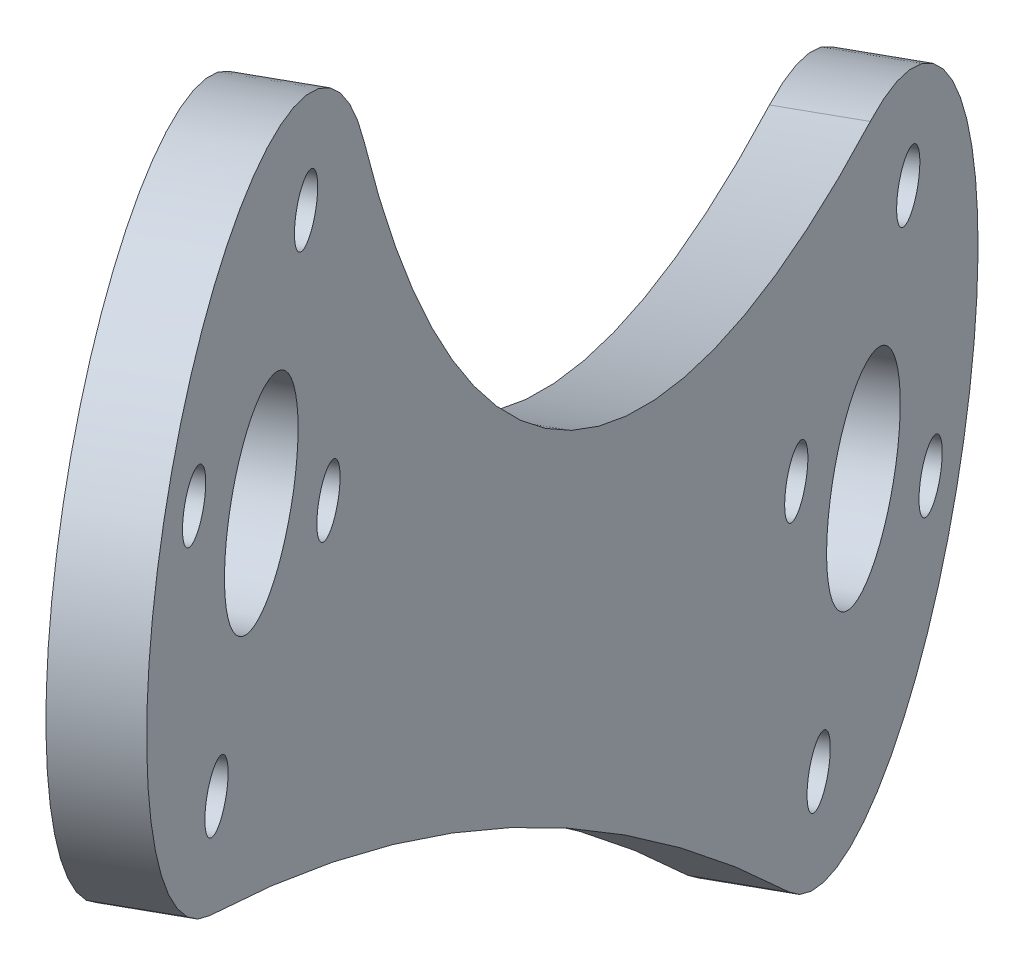
ISO-10303-21;
HEADER;
FILE_DESCRIPTION(('STEP AP214'),'2;1');
FILE_NAME('part.step','',(''),(''),'','','');
FILE_SCHEMA(('AUTOMOTIVE_DESIGN { 1 0 10303 214 1 1 1 1 }'));
ENDSEC;
DATA;
#1=APPLICATION_CONTEXT('core data for automotive mechanical design processes');
#2=APPLICATION_PROTOCOL_DEFINITION('international standard','automotive_design',2000,#1);
#3=PRODUCT_CONTEXT('',#1,'mechanical');
#4=PRODUCT('Part','Part','',(#3));
#5=PRODUCT_RELATED_PRODUCT_CATEGORY('part','',(#4));
#6=PRODUCT_DEFINITION_FORMATION('','',#4);
#7=PRODUCT_DEFINITION_CONTEXT('part definition',#1,'design');
#8=PRODUCT_DEFINITION('design','',#6,#7);
#9=PRODUCT_DEFINITION_SHAPE('','',#8);
#10=(LENGTH_UNIT() NAMED_UNIT(*) SI_UNIT(.MILLI.,.METRE.));
#11=(NAMED_UNIT(*) PLANE_ANGLE_UNIT() SI_UNIT($,.RADIAN.));
#12=(NAMED_UNIT(*) SI_UNIT($,.STERADIAN.) SOLID_ANGLE_UNIT());
#13=UNCERTAINTY_MEASURE_WITH_UNIT(LENGTH_MEASURE(1.E-05),#10,'distance_accuracy_value','');
#14=(GEOMETRIC_REPRESENTATION_CONTEXT(3) GLOBAL_UNCERTAINTY_ASSIGNED_CONTEXT((#13)) GLOBAL_UNIT_ASSIGNED_CONTEXT((#10,
#11,#12)) REPRESENTATION_CONTEXT('',''));
#15=CARTESIAN_POINT('',(0.,0.,0.));
#16=DIRECTION('',(0.,0.,1.));
#17=DIRECTION('',(1.,0.,0.));
#18=AXIS2_PLACEMENT_3D('',#15,#16,#17);
#19=CARTESIAN_POINT('',(111.911596656308,67.6537550601654,142.208933520763));
#20=DIRECTION('',(-0.872839337391939,0.,0.48800767524825));
#21=DIRECTION('',(0.48800767524825,0.,0.872839337391939));
#22=AXIS2_PLACEMENT_3D('',#19,#20,#21);
#23=CYLINDRICAL_SURFACE('',#22,12.065);
#24=CARTESIAN_POINT('',(109.293078644133,67.6537550601655,143.672956546508));
#25=DIRECTION('',(-0.872839337391939,0.,0.48800767524825));
#26=DIRECTION('',(0.48800767524825,0.,0.872839337391939));
#27=AXIS2_PLACEMENT_3D('',#24,#25,#26);
#28=CIRCLE('',#27,12.065);
#29=CARTESIAN_POINT('',(111.946697587866,56.8836065862864,148.419158538845));
#30=VERTEX_POINT('',#29);
#31=CARTESIAN_POINT('',(104.002375438691,72.9478578940215,134.210126114946));
#32=VERTEX_POINT('',#31);
#33=EDGE_CURVE('E99',#30,#32,#28,.T.);
#34=ORIENTED_EDGE('',*,*,#33,.F.);
#35=DIRECTION('',(-0.872839337391939,0.,0.48800767524825));
#36=VECTOR('',#35,1.);
#37=CARTESIAN_POINT('',(114.565215600042,56.8836065862864,146.9551355131));
#38=LINE('',#37,#36);
#39=CARTESIAN_POINT('',(114.565215600042,56.8836065862864,146.9551355131));
#40=VERTEX_POINT('',#39);
#41=EDGE_CURVE('E11',#40,#30,#38,.T.);
#42=ORIENTED_EDGE('',*,*,#41,.F.);
#43=CARTESIAN_POINT('',(111.911596656308,67.6537550601654,142.208933520763));
#44=DIRECTION('',(-0.872839337391939,0.,0.48800767524825));
#45=DIRECTION('',(0.48800767524825,0.,0.872839337391939));
#46=AXIS2_PLACEMENT_3D('',#43,#44,#45);
#47=CIRCLE('',#46,12.065);
#48=CARTESIAN_POINT('',(106.620893450867,72.9478578940215,132.746103089202));
#49=VERTEX_POINT('',#48);
#50=EDGE_CURVE('E92',#40,#49,#47,.T.);
#51=ORIENTED_EDGE('',*,*,#50,.T.);
#52=DIRECTION('',(-0.872839337391939,0.,0.48800767524825));
#53=VECTOR('',#52,1.);
#54=CARTESIAN_POINT('',(106.620893450867,72.9478578940215,132.746103089202));
#55=LINE('',#54,#53);
#56=EDGE_CURVE('E37',#49,#32,#55,.T.);
#57=ORIENTED_EDGE('',*,*,#56,.T.);
#58=EDGE_LOOP('',(#34,#42,#51,#57));
#59=FACE_BOUND('',#58,.T.);
#60=ADVANCED_FACE('F34',(#59),#23,.T.);
#61=CARTESIAN_POINT('',(181.604009968041,-215.204354859077,266.859185845821));
#62=DIRECTION('',(-0.872839337391939,0.,0.48800767524825));
#63=DIRECTION('',(0.48800767524825,0.,0.872839337391939));
#64=AXIS2_PLACEMENT_3D('',#61,#62,#63);
#65=CYLINDRICAL_SURFACE('',#64,304.8);
#66=CARTESIAN_POINT('',(178.985491955865,-215.204354859077,268.323208871565));
#67=DIRECTION('',(0.872839337391939,0.,-0.48800767524825));
#68=DIRECTION('',(-0.48800767524825,0.,-0.872839337391939));
#69=AXIS2_PLACEMENT_3D('',#66,#67,#68);
#70=CIRCLE('',#69,304.8);
#71=CARTESIAN_POINT('',(82.185523297096,16.2202622398334,95.1890046590989));
#72=VERTEX_POINT('',#71);
#73=EDGE_CURVE('E94',#72,#30,#70,.T.);
#74=ORIENTED_EDGE('',*,*,#73,.F.);
#75=DIRECTION('',(-0.872839337391939,0.,0.48800767524825));
#76=VECTOR('',#75,1.);
#77=CARTESIAN_POINT('',(84.8040413092718,16.2202622398333,93.7249816333541));
#78=LINE('',#77,#76);
#79=CARTESIAN_POINT('',(84.8040413092718,16.2202622398333,93.7249816333541));
#80=VERTEX_POINT('',#79);
#81=EDGE_CURVE('E43',#80,#72,#78,.T.);
#82=ORIENTED_EDGE('',*,*,#81,.F.);
#83=CARTESIAN_POINT('',(181.604009968041,-215.204354859077,266.859185845821));
#84=DIRECTION('',(0.872839337391939,0.,-0.48800767524825));
#85=DIRECTION('',(-0.48800767524825,0.,-0.872839337391939));
#86=AXIS2_PLACEMENT_3D('',#83,#84,#85);
#87=CIRCLE('',#86,304.8);
#88=EDGE_CURVE('E89',#80,#40,#87,.T.);
#89=ORIENTED_EDGE('',*,*,#88,.T.);
#90=ORIENTED_EDGE('',*,*,#41,.T.);
#91=EDGE_LOOP('',(#74,#82,#89,#90));
#92=FACE_BOUND('',#91,.T.);
#93=ADVANCED_FACE('F110',(#92),#65,.F.);
#94=CARTESIAN_POINT('',(80.9723758831955,25.3808199999985,86.8717527166106));
#95=DIRECTION('',(-0.872839337391939,0.,0.48800767524825));
#96=DIRECTION('',(0.48800767524825,0.,0.872839337391939));
#97=AXIS2_PLACEMENT_3D('',#94,#95,#96);
#98=CYLINDRICAL_SURFACE('',#97,12.065);
#99=CARTESIAN_POINT('',(78.3538578710197,25.3808199999986,88.3357757423554));
#100=DIRECTION('',(-0.872839337391939,0.,0.48800767524825));
#101=DIRECTION('',(0.48800767524825,0.,0.872839337391939));
#102=AXIS2_PLACEMENT_3D('',#99,#100,#101);
#103=CIRCLE('',#102,12.065);
#104=CARTESIAN_POINT('',(78.0030302512014,37.4243830535451,87.7082935064147));
#105=VERTEX_POINT('',#104);
#106=EDGE_CURVE('E84',#105,#72,#103,.T.);
#107=ORIENTED_EDGE('',*,*,#106,.F.);
#108=DIRECTION('',(-0.872839337391939,0.,0.48800767524825));
#109=VECTOR('',#108,1.);
#110=CARTESIAN_POINT('',(80.6215482633773,37.4243830535451,86.2442704806699));
#111=LINE('',#110,#109);
#112=CARTESIAN_POINT('',(80.6215482633773,37.4243830535451,86.2442704806699));
#113=VERTEX_POINT('',#112);
#114=EDGE_CURVE('E79',#113,#105,#111,.T.);
#115=ORIENTED_EDGE('',*,*,#114,.F.);
#116=CARTESIAN_POINT('',(80.9723758831955,25.3808199999985,86.8717527166106));
#117=DIRECTION('',(-0.872839337391939,0.,0.48800767524825));
#118=DIRECTION('',(0.48800767524825,0.,0.872839337391939));
#119=AXIS2_PLACEMENT_3D('',#116,#117,#118);
#120=CIRCLE('',#119,12.065);
#121=EDGE_CURVE('E82',#113,#80,#120,.T.);
#122=ORIENTED_EDGE('',*,*,#121,.T.);
#123=ORIENTED_EDGE('',*,*,#81,.T.);
#124=EDGE_LOOP('',(#107,#115,#122,#123));
#125=FACE_BOUND('',#124,.T.);
#126=ADVANCED_FACE('F81',(#125),#98,.T.);
#127=CARTESIAN_POINT('',(78.7750871064392,100.81155701958,82.9417323967716));
#128=DIRECTION('',(-0.872839337391939,0.,0.48800767524825));
#129=DIRECTION('',(0.48800767524825,0.,0.872839337391939));
#130=AXIS2_PLACEMENT_3D('',#127,#128,#129);
#131=CYLINDRICAL_SURFACE('',#130,63.5);
#132=CARTESIAN_POINT('',(76.1565690942634,100.81155701958,84.4057554225163));
#133=DIRECTION('',(0.872839337391939,0.,-0.48800767524825));
#134=DIRECTION('',(-0.48800767524825,0.,-0.872839337391939));
#135=AXIS2_PLACEMENT_3D('',#132,#133,#134);
#136=CIRCLE('',#135,63.5);
#137=EDGE_CURVE('E102',#32,#105,#136,.T.);
#138=ORIENTED_EDGE('',*,*,#137,.F.);
#139=ORIENTED_EDGE('',*,*,#56,.F.);
#140=CARTESIAN_POINT('',(78.7750871064392,100.81155701958,82.9417323967716));
#141=DIRECTION('',(0.872839337391939,0.,-0.48800767524825));
#142=DIRECTION('',(-0.48800767524825,0.,-0.872839337391939));
#143=AXIS2_PLACEMENT_3D('',#140,#141,#142);
#144=CIRCLE('',#143,63.5);
#145=EDGE_CURVE('E88',#49,#113,#144,.T.);
#146=ORIENTED_EDGE('',*,*,#145,.T.);
#147=ORIENTED_EDGE('',*,*,#114,.T.);
#148=EDGE_LOOP('',(#138,#139,#146,#147));
#149=FACE_BOUND('',#148,.T.);
#150=ADVANCED_FACE('F91',(#149),#131,.F.);
#151=CARTESIAN_POINT('',(95.3433418813738,84.2326560398725,112.575332958767));
#152=DIRECTION('',(-0.872839337391939,0.,0.48800767524825));
#153=DIRECTION('',(0.48800767524825,0.,0.872839337391939));
#154=AXIS2_PLACEMENT_3D('',#151,#152,#153);
#155=PLANE('',#154);
#156=CARTESIAN_POINT('',(80.9723758831955,25.3808199999985,86.8717527166106));
#157=DIRECTION('',(-0.872839337391939,0.,0.48800767524825));
#158=DIRECTION('',(-0.48800767524825,0.,-0.872839337391939));
#159=AXIS2_PLACEMENT_3D('',#156,#157,#158);
#160=CIRCLE('',#159,3.8735);
#161=CARTESIAN_POINT('',(79.0820781531214,25.3808199999985,83.490809543223));
#162=VERTEX_POINT('',#161);
#163=EDGE_CURVE('E175',#162,#162,#160,.T.);
#164=ORIENTED_EDGE('',*,*,#163,.T.);
#165=EDGE_LOOP('',(#164));
#166=FACE_BOUND('',#165,.T.);
#167=CARTESIAN_POINT('',(111.911596656308,67.6537550601654,142.208933520763));
#168=DIRECTION('',(-0.872839337391939,0.,0.48800767524825));
#169=DIRECTION('',(-0.48800767524825,0.,-0.872839337391939));
#170=AXIS2_PLACEMENT_3D('',#167,#168,#169);
#171=CIRCLE('',#170,3.87349999999996);
#172=CARTESIAN_POINT('',(110.021298926234,67.6537550601654,138.827990347376));
#173=VERTEX_POINT('',#172);
#174=EDGE_CURVE('E183',#173,#173,#171,.T.);
#175=ORIENTED_EDGE('',*,*,#174,.T.);
#176=EDGE_LOOP('',(#175));
#177=FACE_BOUND('',#176,.T.);
#178=CARTESIAN_POINT('',(109.610374061214,74.72591857785,138.093019556762));
#179=DIRECTION('',(-0.872839337391939,0.,0.48800767524825));
#180=DIRECTION('',(-0.48800767524825,0.,-0.872839337391939));
#181=AXIS2_PLACEMENT_3D('',#178,#179,#180);
#182=CIRCLE('',#181,1.21919999999999);
#183=CARTESIAN_POINT('',(109.015395103551,74.72591857785,137.028853836614));
#184=VERTEX_POINT('',#183);
#185=EDGE_CURVE('E189',#184,#184,#182,.T.);
#186=ORIENTED_EDGE('',*,*,#185,.T.);
#187=EDGE_LOOP('',(#186));
#188=FACE_BOUND('',#187,.T.);
#189=CARTESIAN_POINT('',(115.362866733549,72.3693009661271,148.381796039467));
#190=DIRECTION('',(-0.872839337391939,0.,0.48800767524825));
#191=DIRECTION('',(-0.48800767524825,0.,-0.872839337391939));
#192=AXIS2_PLACEMENT_3D('',#189,#190,#191);
#193=CIRCLE('',#192,1.21919999999999);
#194=CARTESIAN_POINT('',(114.767887775887,72.3693009661271,147.317630319318));
#195=VERTEX_POINT('',#194);
#196=EDGE_CURVE('E195',#195,#195,#193,.T.);
#197=ORIENTED_EDGE('',*,*,#196,.T.);
#198=EDGE_LOOP('',(#197));
#199=FACE_BOUND('',#198,.T.);
#200=CARTESIAN_POINT('',(114.212819251403,60.5815915424809,146.324847484764));
#201=DIRECTION('',(-0.872839337391939,0.,0.48800767524825));
#202=DIRECTION('',(-0.48800767524825,0.,-0.872839337391939));
#203=AXIS2_PLACEMENT_3D('',#200,#201,#202);
#204=CIRCLE('',#203,1.21919999999997);
#205=CARTESIAN_POINT('',(113.617840293741,60.5815915424809,145.260681764616));
#206=VERTEX_POINT('',#205);
#207=EDGE_CURVE('E201',#206,#206,#204,.T.);
#208=ORIENTED_EDGE('',*,*,#207,.T.);
#209=EDGE_LOOP('',(#208));
#210=FACE_BOUND('',#209,.T.);
#211=CARTESIAN_POINT('',(108.460326579068,62.9382091542038,136.03607100206));
#212=DIRECTION('',(-0.872839337391939,0.,0.48800767524825));
#213=DIRECTION('',(-0.48800767524825,0.,-0.872839337391939));
#214=AXIS2_PLACEMENT_3D('',#211,#212,#213);
#215=CIRCLE('',#214,1.21919999999998);
#216=CARTESIAN_POINT('',(107.865347621405,62.9382091542038,134.971905281912));
#217=VERTEX_POINT('',#216);
#218=EDGE_CURVE('E207',#217,#217,#215,.T.);
#219=ORIENTED_EDGE('',*,*,#218,.T.);
#220=EDGE_LOOP('',(#219));
#221=FACE_BOUND('',#220,.T.);
#222=CARTESIAN_POINT('',(84.4236459604362,30.0963659059603,93.0446152353138));
#223=DIRECTION('',(-0.872839337391939,0.,0.48800767524825));
#224=DIRECTION('',(-0.48800767524825,0.,-0.872839337391939));
#225=AXIS2_PLACEMENT_3D('',#222,#223,#224);
#226=CIRCLE('',#225,1.21920000000001);
#227=CARTESIAN_POINT('',(83.8286670027735,30.0963659059603,91.9804495151655));
#228=VERTEX_POINT('',#227);
#229=EDGE_CURVE('E213',#228,#228,#226,.T.);
#230=ORIENTED_EDGE('',*,*,#229,.T.);
#231=EDGE_LOOP('',(#230));
#232=FACE_BOUND('',#231,.T.);
#233=CARTESIAN_POINT('',(83.2735984782902,18.3086564823142,90.9876666806113));
#234=DIRECTION('',(-0.872839337391939,0.,0.48800767524825));
#235=DIRECTION('',(-0.48800767524825,0.,-0.872839337391939));
#236=AXIS2_PLACEMENT_3D('',#233,#234,#235);
#237=CIRCLE('',#236,1.21919999999998);
#238=CARTESIAN_POINT('',(82.6786195206275,18.3086564823142,89.9235009604631));
#239=VERTEX_POINT('',#238);
#240=EDGE_CURVE('E219',#239,#239,#237,.T.);
#241=ORIENTED_EDGE('',*,*,#240,.T.);
#242=EDGE_LOOP('',(#241));
#243=FACE_BOUND('',#242,.T.);
#244=CARTESIAN_POINT('',(77.5211058059547,20.6652740940372,80.6988901979073));
#245=DIRECTION('',(-0.872839337391939,0.,0.48800767524825));
#246=DIRECTION('',(-0.48800767524825,0.,-0.872839337391939));
#247=AXIS2_PLACEMENT_3D('',#244,#245,#246);
#248=CIRCLE('',#247,1.21920000000001);
#249=CARTESIAN_POINT('',(76.926126848292,20.6652740940372,79.634724477759));
#250=VERTEX_POINT('',#249);
#251=EDGE_CURVE('E225',#250,#250,#248,.T.);
#252=ORIENTED_EDGE('',*,*,#251,.T.);
#253=EDGE_LOOP('',(#252));
#254=FACE_BOUND('',#253,.T.);
#255=CARTESIAN_POINT('',(78.6711532881007,32.4529835176833,82.7558387526097));
#256=DIRECTION('',(-0.872839337391939,0.,0.48800767524825));
#257=DIRECTION('',(-0.48800767524825,0.,-0.872839337391939));
#258=AXIS2_PLACEMENT_3D('',#255,#256,#257);
#259=CIRCLE('',#258,1.21920000000001);
#260=CARTESIAN_POINT('',(78.0761743304381,32.4529835176833,81.6916730324615));
#261=VERTEX_POINT('',#260);
#262=EDGE_CURVE('E103',#261,#261,#259,.T.);
#263=ORIENTED_EDGE('',*,*,#262,.T.);
#264=EDGE_LOOP('',(#263));
#265=FACE_BOUND('',#264,.T.);
#266=ORIENTED_EDGE('',*,*,#50,.F.);
#267=ORIENTED_EDGE('',*,*,#88,.F.);
#268=ORIENTED_EDGE('',*,*,#121,.F.);
#269=ORIENTED_EDGE('',*,*,#145,.F.);
#270=EDGE_LOOP('',(#266,#267,#268,#269));
#271=FACE_BOUND('',#270,.T.);
#272=ADVANCED_FACE('F87',(#166,#177,#188,#199,#210,#221,#232,#243,#254,#265,#271),#155,.F.);
#273=CARTESIAN_POINT('',(92.724823869198,84.2326560398725,114.039355984512));
#274=DIRECTION('',(-0.872839337391939,0.,0.48800767524825));
#275=DIRECTION('',(0.48800767524825,0.,0.872839337391939));
#276=AXIS2_PLACEMENT_3D('',#273,#274,#275);
#277=PLANE('',#276);
#278=CARTESIAN_POINT('',(78.3538578710197,25.3808199999986,88.3357757423554));
#279=DIRECTION('',(-0.872839337391939,0.,0.48800767524825));
#280=DIRECTION('',(-0.48800767524825,0.,-0.872839337391939));
#281=AXIS2_PLACEMENT_3D('',#278,#279,#280);
#282=CIRCLE('',#281,3.8735);
#283=CARTESIAN_POINT('',(76.4635601409456,25.3808199999986,84.9548325689677));
#284=VERTEX_POINT('',#283);
#285=EDGE_CURVE('E178',#284,#284,#282,.T.);
#286=ORIENTED_EDGE('',*,*,#285,.F.);
#287=EDGE_LOOP('',(#286));
#288=FACE_BOUND('',#287,.T.);
#289=CARTESIAN_POINT('',(109.293078644133,67.6537550601655,143.672956546508));
#290=DIRECTION('',(-0.872839337391939,0.,0.48800767524825));
#291=DIRECTION('',(-0.48800767524825,0.,-0.872839337391939));
#292=AXIS2_PLACEMENT_3D('',#289,#290,#291);
#293=CIRCLE('',#292,3.87349999999996);
#294=CARTESIAN_POINT('',(107.402780914059,67.6537550601655,140.29201337312));
#295=VERTEX_POINT('',#294);
#296=EDGE_CURVE('E180',#295,#295,#293,.T.);
#297=ORIENTED_EDGE('',*,*,#296,.F.);
#298=EDGE_LOOP('',(#297));
#299=FACE_BOUND('',#298,.T.);
#300=CARTESIAN_POINT('',(106.991856049038,74.72591857785,139.557042582507));
#301=DIRECTION('',(-0.872839337391939,0.,0.48800767524825));
#302=DIRECTION('',(-0.48800767524825,0.,-0.872839337391939));
#303=AXIS2_PLACEMENT_3D('',#300,#301,#302);
#304=CIRCLE('',#303,1.21919999999999);
#305=CARTESIAN_POINT('',(106.396877091375,74.72591857785,138.492876862359));
#306=VERTEX_POINT('',#305);
#307=EDGE_CURVE('E186',#306,#306,#304,.T.);
#308=ORIENTED_EDGE('',*,*,#307,.F.);
#309=EDGE_LOOP('',(#308));
#310=FACE_BOUND('',#309,.T.);
#311=CARTESIAN_POINT('',(112.744348721373,72.3693009661271,149.845819065211));
#312=DIRECTION('',(-0.872839337391939,0.,0.48800767524825));
#313=DIRECTION('',(-0.48800767524825,0.,-0.872839337391939));
#314=AXIS2_PLACEMENT_3D('',#311,#312,#313);
#315=CIRCLE('',#314,1.21919999999999);
#316=CARTESIAN_POINT('',(112.149369763711,72.3693009661271,148.781653345063));
#317=VERTEX_POINT('',#316);
#318=EDGE_CURVE('E192',#317,#317,#315,.T.);
#319=ORIENTED_EDGE('',*,*,#318,.F.);
#320=EDGE_LOOP('',(#319));
#321=FACE_BOUND('',#320,.T.);
#322=CARTESIAN_POINT('',(111.594301239227,60.5815915424809,147.788870510509));
#323=DIRECTION('',(-0.872839337391939,0.,0.48800767524825));
#324=DIRECTION('',(-0.48800767524825,0.,-0.872839337391939));
#325=AXIS2_PLACEMENT_3D('',#322,#323,#324);
#326=CIRCLE('',#325,1.21919999999997);
#327=CARTESIAN_POINT('',(110.999322281565,60.5815915424809,146.724704790361));
#328=VERTEX_POINT('',#327);
#329=EDGE_CURVE('E198',#328,#328,#326,.T.);
#330=ORIENTED_EDGE('',*,*,#329,.F.);
#331=EDGE_LOOP('',(#330));
#332=FACE_BOUND('',#331,.T.);
#333=CARTESIAN_POINT('',(105.841808566892,62.9382091542038,137.500094027805));
#334=DIRECTION('',(-0.872839337391939,0.,0.48800767524825));
#335=DIRECTION('',(-0.48800767524825,0.,-0.872839337391939));
#336=AXIS2_PLACEMENT_3D('',#333,#334,#335);
#337=CIRCLE('',#336,1.21919999999998);
#338=CARTESIAN_POINT('',(105.246829609229,62.9382091542038,136.435928307657));
#339=VERTEX_POINT('',#338);
#340=EDGE_CURVE('E204',#339,#339,#337,.T.);
#341=ORIENTED_EDGE('',*,*,#340,.F.);
#342=EDGE_LOOP('',(#341));
#343=FACE_BOUND('',#342,.T.);
#344=CARTESIAN_POINT('',(81.8051279482604,30.0963659059603,94.5086382610585));
#345=DIRECTION('',(-0.872839337391939,0.,0.48800767524825));
#346=DIRECTION('',(-0.48800767524825,0.,-0.872839337391939));
#347=AXIS2_PLACEMENT_3D('',#344,#345,#346);
#348=CIRCLE('',#347,1.21920000000001);
#349=CARTESIAN_POINT('',(81.2101489905977,30.0963659059603,93.4444725409103));
#350=VERTEX_POINT('',#349);
#351=EDGE_CURVE('E210',#350,#350,#348,.T.);
#352=ORIENTED_EDGE('',*,*,#351,.F.);
#353=EDGE_LOOP('',(#352));
#354=FACE_BOUND('',#353,.T.);
#355=CARTESIAN_POINT('',(80.6550804661143,18.3086564823142,92.4516897063561));
#356=DIRECTION('',(-0.872839337391939,0.,0.48800767524825));
#357=DIRECTION('',(-0.48800767524825,0.,-0.872839337391939));
#358=AXIS2_PLACEMENT_3D('',#355,#356,#357);
#359=CIRCLE('',#358,1.21919999999998);
#360=CARTESIAN_POINT('',(80.0601015084517,18.3086564823142,91.3875239862079));
#361=VERTEX_POINT('',#360);
#362=EDGE_CURVE('E216',#361,#361,#359,.T.);
#363=ORIENTED_EDGE('',*,*,#362,.F.);
#364=EDGE_LOOP('',(#363));
#365=FACE_BOUND('',#364,.T.);
#366=CARTESIAN_POINT('',(74.9025877937788,20.6652740940372,82.162913223652));
#367=DIRECTION('',(-0.872839337391939,0.,0.48800767524825));
#368=DIRECTION('',(-0.48800767524825,0.,-0.872839337391939));
#369=AXIS2_PLACEMENT_3D('',#366,#367,#368);
#370=CIRCLE('',#369,1.21920000000001);
#371=CARTESIAN_POINT('',(74.3076088361162,20.6652740940372,81.0987475035037));
#372=VERTEX_POINT('',#371);
#373=EDGE_CURVE('E222',#372,#372,#370,.T.);
#374=ORIENTED_EDGE('',*,*,#373,.F.);
#375=EDGE_LOOP('',(#374));
#376=FACE_BOUND('',#375,.T.);
#377=CARTESIAN_POINT('',(76.0526352759249,32.4529835176833,84.2198617783545));
#378=DIRECTION('',(-0.872839337391939,0.,0.48800767524825));
#379=DIRECTION('',(-0.48800767524825,0.,-0.872839337391939));
#380=AXIS2_PLACEMENT_3D('',#377,#378,#379);
#381=CIRCLE('',#380,1.21920000000001);
#382=CARTESIAN_POINT('',(75.4576563182622,32.4529835176833,83.1556960582062));
#383=VERTEX_POINT('',#382);
#384=EDGE_CURVE('E228',#383,#383,#381,.T.);
#385=ORIENTED_EDGE('',*,*,#384,.F.);
#386=EDGE_LOOP('',(#385));
#387=FACE_BOUND('',#386,.T.);
#388=ORIENTED_EDGE('',*,*,#33,.T.);
#389=ORIENTED_EDGE('',*,*,#137,.T.);
#390=ORIENTED_EDGE('',*,*,#106,.T.);
#391=ORIENTED_EDGE('',*,*,#73,.T.);
#392=EDGE_LOOP('',(#388,#389,#390,#391));
#393=FACE_BOUND('',#392,.T.);
#394=ADVANCED_FACE('F109',(#288,#299,#310,#321,#332,#343,#354,#365,#376,#387,#393),#277,.T.);
#395=CARTESIAN_POINT('',(78.6711532881007,32.4529835176833,82.7558387526097));
#396=DIRECTION('',(-0.872839337391939,0.,0.48800767524825));
#397=DIRECTION('',(0.48800767524825,0.,0.872839337391939));
#398=AXIS2_PLACEMENT_3D('',#395,#396,#397);
#399=CYLINDRICAL_SURFACE('',#398,1.21920000000001);
#400=ORIENTED_EDGE('',*,*,#262,.F.);
#401=EDGE_LOOP('',(#400));
#402=FACE_BOUND('',#401,.T.);
#403=ORIENTED_EDGE('',*,*,#384,.T.);
#404=EDGE_LOOP('',(#403));
#405=FACE_BOUND('',#404,.T.);
#406=ADVANCED_FACE('F128',(#402,#405),#399,.F.);
#407=CARTESIAN_POINT('',(77.5211058059547,20.6652740940372,80.6988901979073));
#408=DIRECTION('',(-0.872839337391939,0.,0.48800767524825));
#409=DIRECTION('',(0.48800767524825,0.,0.872839337391939));
#410=AXIS2_PLACEMENT_3D('',#407,#408,#409);
#411=CYLINDRICAL_SURFACE('',#410,1.21920000000001);
#412=ORIENTED_EDGE('',*,*,#251,.F.);
#413=EDGE_LOOP('',(#412));
#414=FACE_BOUND('',#413,.T.);
#415=ORIENTED_EDGE('',*,*,#373,.T.);
#416=EDGE_LOOP('',(#415));
#417=FACE_BOUND('',#416,.T.);
#418=ADVANCED_FACE('F135',(#414,#417),#411,.F.);
#419=CARTESIAN_POINT('',(83.2735984782902,18.3086564823142,90.9876666806113));
#420=DIRECTION('',(-0.872839337391939,0.,0.48800767524825));
#421=DIRECTION('',(0.48800767524825,0.,0.872839337391939));
#422=AXIS2_PLACEMENT_3D('',#419,#420,#421);
#423=CYLINDRICAL_SURFACE('',#422,1.21919999999998);
#424=ORIENTED_EDGE('',*,*,#240,.F.);
#425=EDGE_LOOP('',(#424));
#426=FACE_BOUND('',#425,.T.);
#427=ORIENTED_EDGE('',*,*,#362,.T.);
#428=EDGE_LOOP('',(#427));
#429=FACE_BOUND('',#428,.T.);
#430=ADVANCED_FACE('F139',(#426,#429),#423,.F.);
#431=CARTESIAN_POINT('',(84.4236459604362,30.0963659059603,93.0446152353138));
#432=DIRECTION('',(-0.872839337391939,0.,0.48800767524825));
#433=DIRECTION('',(0.48800767524825,0.,0.872839337391939));
#434=AXIS2_PLACEMENT_3D('',#431,#432,#433);
#435=CYLINDRICAL_SURFACE('',#434,1.21920000000001);
#436=ORIENTED_EDGE('',*,*,#229,.F.);
#437=EDGE_LOOP('',(#436));
#438=FACE_BOUND('',#437,.T.);
#439=ORIENTED_EDGE('',*,*,#351,.T.);
#440=EDGE_LOOP('',(#439));
#441=FACE_BOUND('',#440,.T.);
#442=ADVANCED_FACE('F143',(#438,#441),#435,.F.);
#443=CARTESIAN_POINT('',(108.460326579068,62.9382091542038,136.03607100206));
#444=DIRECTION('',(-0.872839337391939,0.,0.48800767524825));
#445=DIRECTION('',(0.48800767524825,0.,0.872839337391939));
#446=AXIS2_PLACEMENT_3D('',#443,#444,#445);
#447=CYLINDRICAL_SURFACE('',#446,1.21919999999998);
#448=ORIENTED_EDGE('',*,*,#218,.F.);
#449=EDGE_LOOP('',(#448));
#450=FACE_BOUND('',#449,.T.);
#451=ORIENTED_EDGE('',*,*,#340,.T.);
#452=EDGE_LOOP('',(#451));
#453=FACE_BOUND('',#452,.T.);
#454=ADVANCED_FACE('F147',(#450,#453),#447,.F.);
#455=CARTESIAN_POINT('',(114.212819251403,60.5815915424809,146.324847484764));
#456=DIRECTION('',(-0.872839337391939,0.,0.48800767524825));
#457=DIRECTION('',(0.48800767524825,0.,0.872839337391939));
#458=AXIS2_PLACEMENT_3D('',#455,#456,#457);
#459=CYLINDRICAL_SURFACE('',#458,1.21919999999997);
#460=ORIENTED_EDGE('',*,*,#207,.F.);
#461=EDGE_LOOP('',(#460));
#462=FACE_BOUND('',#461,.T.);
#463=ORIENTED_EDGE('',*,*,#329,.T.);
#464=EDGE_LOOP('',(#463));
#465=FACE_BOUND('',#464,.T.);
#466=ADVANCED_FACE('F151',(#462,#465),#459,.F.);
#467=CARTESIAN_POINT('',(115.362866733549,72.3693009661271,148.381796039467));
#468=DIRECTION('',(-0.872839337391939,0.,0.48800767524825));
#469=DIRECTION('',(0.48800767524825,0.,0.872839337391939));
#470=AXIS2_PLACEMENT_3D('',#467,#468,#469);
#471=CYLINDRICAL_SURFACE('',#470,1.21919999999999);
#472=ORIENTED_EDGE('',*,*,#196,.F.);
#473=EDGE_LOOP('',(#472));
#474=FACE_BOUND('',#473,.T.);
#475=ORIENTED_EDGE('',*,*,#318,.T.);
#476=EDGE_LOOP('',(#475));
#477=FACE_BOUND('',#476,.T.);
#478=ADVANCED_FACE('F155',(#474,#477),#471,.F.);
#479=CARTESIAN_POINT('',(109.610374061214,74.72591857785,138.093019556762));
#480=DIRECTION('',(-0.872839337391939,0.,0.48800767524825));
#481=DIRECTION('',(0.48800767524825,0.,0.872839337391939));
#482=AXIS2_PLACEMENT_3D('',#479,#480,#481);
#483=CYLINDRICAL_SURFACE('',#482,1.21919999999999);
#484=ORIENTED_EDGE('',*,*,#185,.F.);
#485=EDGE_LOOP('',(#484));
#486=FACE_BOUND('',#485,.T.);
#487=ORIENTED_EDGE('',*,*,#307,.T.);
#488=EDGE_LOOP('',(#487));
#489=FACE_BOUND('',#488,.T.);
#490=ADVANCED_FACE('F159',(#486,#489),#483,.F.);
#491=CARTESIAN_POINT('',(111.911596656308,67.6537550601654,142.208933520763));
#492=DIRECTION('',(-0.872839337391939,0.,0.48800767524825));
#493=DIRECTION('',(0.48800767524825,0.,0.872839337391939));
#494=AXIS2_PLACEMENT_3D('',#491,#492,#493);
#495=CYLINDRICAL_SURFACE('',#494,3.87349999999996);
#496=ORIENTED_EDGE('',*,*,#174,.F.);
#497=EDGE_LOOP('',(#496));
#498=FACE_BOUND('',#497,.T.);
#499=ORIENTED_EDGE('',*,*,#296,.T.);
#500=EDGE_LOOP('',(#499));
#501=FACE_BOUND('',#500,.T.);
#502=ADVANCED_FACE('F163',(#498,#501),#495,.F.);
#503=CARTESIAN_POINT('',(80.9723758831955,25.3808199999985,86.8717527166106));
#504=DIRECTION('',(-0.872839337391939,0.,0.48800767524825));
#505=DIRECTION('',(0.48800767524825,0.,0.872839337391939));
#506=AXIS2_PLACEMENT_3D('',#503,#504,#505);
#507=CYLINDRICAL_SURFACE('',#506,3.8735);
#508=ORIENTED_EDGE('',*,*,#163,.F.);
#509=EDGE_LOOP('',(#508));
#510=FACE_BOUND('',#509,.T.);
#511=ORIENTED_EDGE('',*,*,#285,.T.);
#512=EDGE_LOOP('',(#511));
#513=FACE_BOUND('',#512,.T.);
#514=ADVANCED_FACE('F167',(#510,#513),#507,.F.);
#515=CLOSED_SHELL('',(#60,#93,#126,#150,#272,#394,#406,#418,#430,#442,#454,#466,#478,#490,#502,#514));
#516=MANIFOLD_SOLID_BREP('B2',#515);
#517=ADVANCED_BREP_SHAPE_REPRESENTATION('',(#18,#516),#14);
#518=SHAPE_DEFINITION_REPRESENTATION(#9,#517);
ENDSEC;
END-ISO-10303-21;
